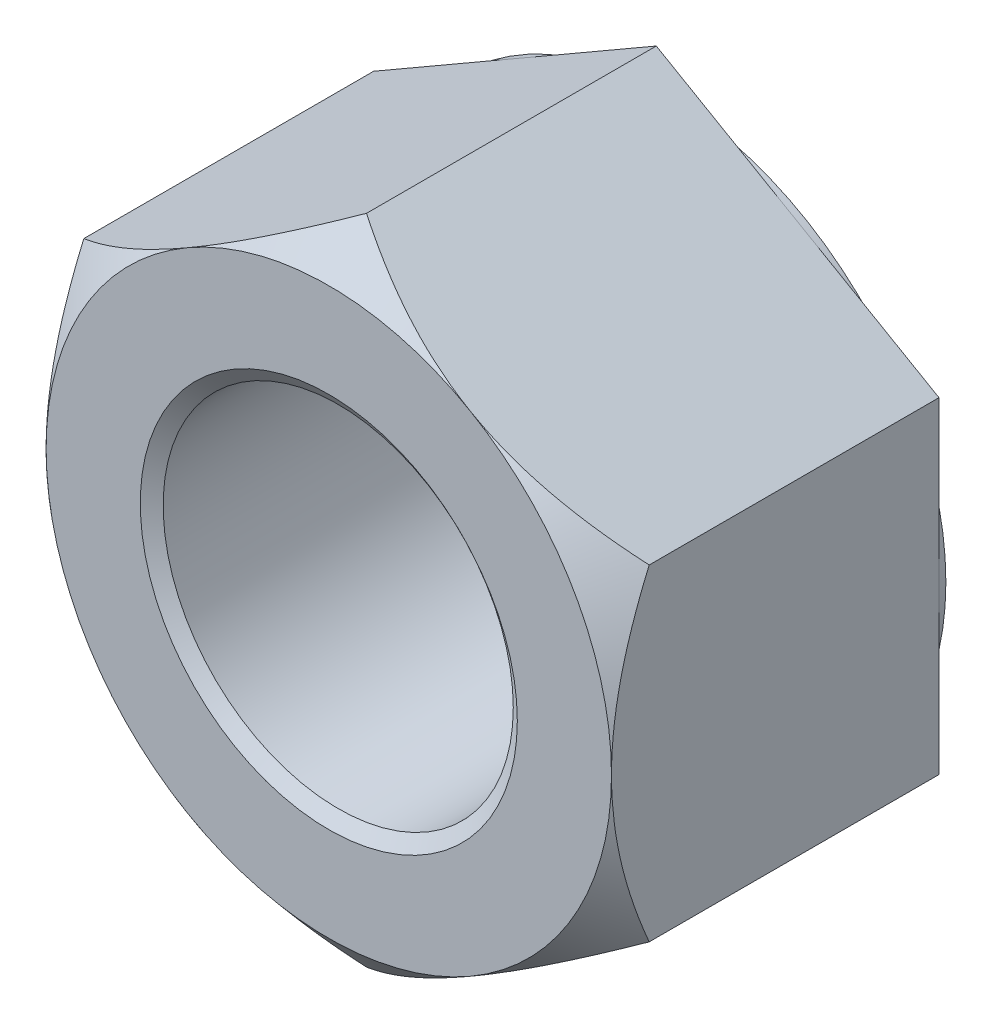
ISO-10303-21;
HEADER;
FILE_DESCRIPTION(('STEP AP214'),'2;1');
FILE_NAME('part.step','',(''),(''),'','','');
FILE_SCHEMA(('AUTOMOTIVE_DESIGN { 1 0 10303 214 1 1 1 1 }'));
ENDSEC;
DATA;
#1=APPLICATION_CONTEXT('core data for automotive mechanical design processes');
#2=APPLICATION_PROTOCOL_DEFINITION('international standard','automotive_design',2000,#1);
#3=PRODUCT_CONTEXT('',#1,'mechanical');
#4=PRODUCT('Part','Part','',(#3));
#5=PRODUCT_RELATED_PRODUCT_CATEGORY('part','',(#4));
#6=PRODUCT_DEFINITION_FORMATION('','',#4);
#7=PRODUCT_DEFINITION_CONTEXT('part definition',#1,'design');
#8=PRODUCT_DEFINITION('design','',#6,#7);
#9=PRODUCT_DEFINITION_SHAPE('','',#8);
#10=(LENGTH_UNIT() NAMED_UNIT(*) SI_UNIT(.MILLI.,.METRE.));
#11=(NAMED_UNIT(*) PLANE_ANGLE_UNIT() SI_UNIT($,.RADIAN.));
#12=(NAMED_UNIT(*) SI_UNIT($,.STERADIAN.) SOLID_ANGLE_UNIT());
#13=UNCERTAINTY_MEASURE_WITH_UNIT(LENGTH_MEASURE(1.E-05),#10,'distance_accuracy_value','');
#14=(GEOMETRIC_REPRESENTATION_CONTEXT(3) GLOBAL_UNCERTAINTY_ASSIGNED_CONTEXT((#13)) GLOBAL_UNIT_ASSIGNED_CONTEXT((#10,
#11,#12)) REPRESENTATION_CONTEXT('',''));
#15=CARTESIAN_POINT('',(0.,0.,0.));
#16=DIRECTION('',(0.,0.,1.));
#17=DIRECTION('',(1.,0.,0.));
#18=AXIS2_PLACEMENT_3D('',#15,#16,#17);
#19=CARTESIAN_POINT('',(0.,0.,-19.7104));
#20=DIRECTION('',(0.,0.,1.));
#21=DIRECTION('',(1.,0.,0.));
#22=AXIS2_PLACEMENT_3D('',#19,#20,#21);
#23=CYLINDRICAL_SURFACE('',#22,10.31875);
#24=CARTESIAN_POINT('',(0.,0.,-0.555789733453959));
#25=DIRECTION('',(0.,0.,1.));
#26=DIRECTION('',(1.,0.,0.));
#27=AXIS2_PLACEMENT_3D('',#24,#25,#26);
#28=CIRCLE('',#27,10.31875);
#29=CARTESIAN_POINT('',(10.31875,0.,-0.555789733453959));
#30=VERTEX_POINT('',#29);
#31=EDGE_CURVE('E159',#30,#30,#28,.F.);
#32=ORIENTED_EDGE('',*,*,#31,.F.);
#33=EDGE_LOOP('',(#32));
#34=FACE_BOUND('',#33,.T.);
#35=CARTESIAN_POINT('',(0.,0.,-19.129210266546));
#36=DIRECTION('',(0.,0.,-1.));
#37=DIRECTION('',(-1.,0.,0.));
#38=AXIS2_PLACEMENT_3D('',#35,#36,#37);
#39=CIRCLE('',#38,10.31875);
#40=CARTESIAN_POINT('',(-10.31875,0.,-19.129210266546));
#41=VERTEX_POINT('',#40);
#42=EDGE_CURVE('E47',#41,#41,#39,.F.);
#43=ORIENTED_EDGE('',*,*,#42,.F.);
#44=EDGE_LOOP('',(#43));
#45=FACE_BOUND('',#44,.T.);
#46=ADVANCED_FACE('F42',(#34,#45),#23,.F.);
#47=CARTESIAN_POINT('',(0.,19.2400822506905,-19.7104));
#48=DIRECTION('',(-0.500000000000001,0.866025403784438,0.));
#49=DIRECTION('',(-0.866025403784438,-0.500000000000001,0.));
#50=AXIS2_PLACEMENT_3D('',#47,#48,#49);
#51=PLANE('',#50);
#52=DIRECTION('',(0.,0.,1.));
#53=VECTOR('',#52,1.);
#54=CARTESIAN_POINT('',(-16.6624,9.62004112534521,-19.7104));
#55=LINE('',#54,#53);
#56=CARTESIAN_POINT('',(-16.6624,9.62004112534521,-19.304));
#57=VERTEX_POINT('',#56);
#58=CARTESIAN_POINT('',(-16.6624,9.62004112534521,-2.2225));
#59=VERTEX_POINT('',#58);
#60=EDGE_CURVE('E297',#57,#59,#55,.T.);
#61=ORIENTED_EDGE('',*,*,#60,.T.);
#62=CARTESIAN_POINT('',(-16.6626,9.61992565529138,-2.22259956017846));
#63=CARTESIAN_POINT('',(-16.3359914069942,9.80849321438293,-2.06004001330328));
#64=CARTESIAN_POINT('',(-16.00708321829,9.99838844566996,-1.90345067500589));
#65=CARTESIAN_POINT('',(-15.3443547456618,10.3810149077415,-1.60414393365779));
#66=CARTESIAN_POINT('',(-15.0105316908675,10.5737477382887,-1.46143472987974));
#67=CARTESIAN_POINT('',(-14.3363366999857,10.9629943977606,-1.19133148853535));
#68=CARTESIAN_POINT('',(-13.9959401193921,11.1595224551975,-1.06401888683919));
#69=CARTESIAN_POINT('',(-13.3104110131345,11.5553128692327,-0.827853893406277));
#70=CARTESIAN_POINT('',(-12.9652792905679,11.7545747621624,-0.71899841210642));
#71=CARTESIAN_POINT('',(-12.2767892060713,12.1520746977809,-0.52380403910565));
#72=CARTESIAN_POINT('',(-11.9335096331595,12.3502672516088,-0.437097069433945));
#73=CARTESIAN_POINT('',(-11.2432752736687,12.7487742448647,-0.285791409597032));
#74=CARTESIAN_POINT('',(-10.8963203779458,12.949088747307,-0.221193377896618));
#75=CARTESIAN_POINT('',(-10.2004495898861,13.3508499341145,-0.115998073839297));
#76=CARTESIAN_POINT('',(-9.85153970898105,13.5522931477779,-0.0753481902800202));
#77=CARTESIAN_POINT('',(-9.15221444494224,13.9560487772219,-0.0190524535448443));
#78=CARTESIAN_POINT('',(-8.80179917204902,14.1583611293549,-0.00340479971755249));
#79=CARTESIAN_POINT('',(-8.14974966016309,14.5348220905672,0.00200363509268597));
#80=CARTESIAN_POINT('',(-7.84813263016975,14.708960764026,-0.00492755747404597));
#81=CARTESIAN_POINT('',(-7.24566622078218,15.0567949076637,-0.0374814638258579));
#82=CARTESIAN_POINT('',(-6.94481681594919,15.2304903925295,-0.0631035499129201));
#83=CARTESIAN_POINT('',(-6.34447690427329,15.5770968021409,-0.132482558325232));
#84=CARTESIAN_POINT('',(-6.04498756801866,15.7500070510469,-0.176252888992827));
#85=CARTESIAN_POINT('',(-5.44828309973434,16.0945145364375,-0.280989484638122));
#86=CARTESIAN_POINT('',(-5.15106800050004,16.2661117539877,-0.341955997113344));
#87=CARTESIAN_POINT('',(-4.55940348198139,16.6077094230244,-0.479902459422663));
#88=CARTESIAN_POINT('',(-4.26495448462101,16.777709630913,-0.556884812055613));
#89=CARTESIAN_POINT('',(-3.67921044969725,17.1158891071525,-0.725521314999777));
#90=CARTESIAN_POINT('',(-3.38791589012623,17.2840680995343,-0.817177656546836));
#91=CARTESIAN_POINT('',(-2.51940637621614,17.785502301184,-1.11195820496731));
#92=CARTESIAN_POINT('',(-1.94718945013523,18.1158718974917,-1.3349849912843));
#93=CARTESIAN_POINT('',(-1.14906027506947,18.576671991564,-1.67975192686912));
#94=CARTESIAN_POINT('',(-0.917263659966787,18.7104998296908,-1.78398664917475));
#95=CARTESIAN_POINT('',(-0.456557869340144,18.9764884419263,-1.99871269404115));
#96=CARTESIAN_POINT('',(-0.227642719410924,19.1086526653595,-2.10918690693679));
#97=CARTESIAN_POINT('',(0.000200000000011601,19.2401977207443,-2.22259956017845));
#98=B_SPLINE_CURVE_WITH_KNOTS('',3,(#62,#63,#64,#65,#66,#67,#68,#69,#70,#71,#72,#73,#74,#75,#76,
#77,#78,#79,#80,#81,#82,#83,#84,#85,#86,#87,#88,#89,#90,#91,#92,#93,#94,#95,#96,#97),
.UNSPECIFIED.,.F.,.F.,(4,2,2,2,2,2,2,2,2,2,2,2,2,2,2,2,2,4),(0.,1.23209467877341,
2.46491281546341,3.70399013963489,4.94285984772324,6.15955981590395,7.37629601759317,
8.59034913099073,9.80431480478778,10.8488580904928,11.8933662988182,12.9386475929475,
13.9839439321452,15.0293972066247,16.0750067423026,18.1648984651463,19.026559859433,
19.8859634648151),.UNSPECIFIED.);
#99=CARTESIAN_POINT('',(-8.33120000000001,14.4300616880178,0.));
#100=VERTEX_POINT('',#99);
#101=EDGE_CURVE('E145',#59,#100,#98,.T.);
#102=ORIENTED_EDGE('',*,*,#101,.T.);
#103=CARTESIAN_POINT('',(0.,19.2400822506905,-2.2225));
#104=VERTEX_POINT('',#103);
#105=EDGE_CURVE('E172',#100,#104,#98,.T.);
#106=ORIENTED_EDGE('',*,*,#105,.T.);
#107=DIRECTION('',(0.,0.,1.));
#108=VECTOR('',#107,1.);
#109=CARTESIAN_POINT('',(0.,19.2400822506905,-19.7104));
#110=LINE('',#109,#108);
#111=CARTESIAN_POINT('',(0.,19.2400822506905,-19.304));
#112=VERTEX_POINT('',#111);
#113=EDGE_CURVE('E285',#112,#104,#110,.T.);
#114=ORIENTED_EDGE('',*,*,#113,.F.);
#115=DIRECTION('',(-0.866025403784438,-0.500000000000001,0.));
#116=VECTOR('',#115,1.);
#117=CARTESIAN_POINT('',(0.,19.2400822506905,-19.304));
#118=LINE('',#117,#116);
#119=CARTESIAN_POINT('',(-8.33120000000001,14.4300616880178,-19.304));
#120=VERTEX_POINT('',#119);
#121=EDGE_CURVE('E273',#112,#120,#118,.T.);
#122=ORIENTED_EDGE('',*,*,#121,.T.);
#123=EDGE_CURVE('E269',#120,#57,#118,.T.);
#124=ORIENTED_EDGE('',*,*,#123,.T.);
#125=EDGE_LOOP('',(#61,#102,#106,#114,#122,#124));
#126=FACE_BOUND('',#125,.T.);
#127=ADVANCED_FACE('F44',(#126),#51,.T.);
#128=CARTESIAN_POINT('',(16.6624,9.62004112534521,-19.7104));
#129=DIRECTION('',(0.500000000000001,0.866025403784438,0.));
#130=DIRECTION('',(-0.866025403784438,0.500000000000001,0.));
#131=AXIS2_PLACEMENT_3D('',#128,#129,#130);
#132=PLANE('',#131);
#133=ORIENTED_EDGE('',*,*,#113,.T.);
#134=CARTESIAN_POINT('',(-0.000199999999995952,19.2401977207443,-2.22259956017847));
#135=CARTESIAN_POINT('',(0.326408593005819,19.0516301616527,-2.06004001330329));
#136=CARTESIAN_POINT('',(0.655316781710009,18.8617349303657,-1.9034506750059));
#137=CARTESIAN_POINT('',(1.31804525433819,18.4791084682942,-1.6041439336578));
#138=CARTESIAN_POINT('',(1.65186830913254,18.286375637747,-1.46143472987975));
#139=CARTESIAN_POINT('',(2.32606330001435,17.8971289782751,-1.19133148853536));
#140=CARTESIAN_POINT('',(2.6664598806079,17.7006009208381,-1.06401888683919));
#141=CARTESIAN_POINT('',(3.35198898686555,17.304810506803,-0.82785389340628));
#142=CARTESIAN_POINT('',(3.69712070943212,17.1055486138733,-0.718998412106425));
#143=CARTESIAN_POINT('',(4.38561079392877,16.7080486782547,-0.523804039105654));
#144=CARTESIAN_POINT('',(4.72889036684054,16.5098561244268,-0.437097069433946));
#145=CARTESIAN_POINT('',(5.41912472633128,16.1113491311709,-0.285791409597032));
#146=CARTESIAN_POINT('',(5.76607962205423,15.9110346287286,-0.221193377896621));
#147=CARTESIAN_POINT('',(6.46195041011389,15.5092734419212,-0.1159980738393));
#148=CARTESIAN_POINT('',(6.81086029101898,15.3078302282577,-0.0753481902800202));
#149=CARTESIAN_POINT('',(7.51018555505779,14.9040745988138,-0.0190524535448429));
#150=CARTESIAN_POINT('',(7.86060082795101,14.7017622466807,-0.00340479971755274));
#151=CARTESIAN_POINT('',(8.51265033983695,14.3253012854684,0.0020036350926848));
#152=CARTESIAN_POINT('',(8.81426736983028,14.1511626120096,-0.00492755747404684));
#153=CARTESIAN_POINT('',(9.41673377921785,13.803328468372,-0.03748146382586));
#154=CARTESIAN_POINT('',(9.71758318405085,13.6296329835061,-0.0631035499129238));
#155=CARTESIAN_POINT('',(10.3179230957267,13.2830265738947,-0.132482558325236));
#156=CARTESIAN_POINT('',(10.6174124319814,13.1101163249887,-0.17625288899283));
#157=CARTESIAN_POINT('',(11.2141169002657,12.7656088395981,-0.280989484638124));
#158=CARTESIAN_POINT('',(11.5113319995,12.594011622048,-0.341955997113345));
#159=CARTESIAN_POINT('',(12.1029965180186,12.2524139530113,-0.479902459422664));
#160=CARTESIAN_POINT('',(12.397445515379,12.0824137451226,-0.556884812055615));
#161=CARTESIAN_POINT('',(12.9831895503028,11.7442342688832,-0.72552131499978));
#162=CARTESIAN_POINT('',(13.2744841098738,11.5760552765014,-0.817177656546841));
#163=CARTESIAN_POINT('',(14.1429936237839,11.0746210748516,-1.11195820496731));
#164=CARTESIAN_POINT('',(14.7152105498648,10.744251478544,-1.33498499128431));
#165=CARTESIAN_POINT('',(15.5133397249306,10.2834513844717,-1.67975192686912));
#166=CARTESIAN_POINT('',(15.7451363400332,10.1496235463449,-1.78398664917475));
#167=CARTESIAN_POINT('',(16.2058421306599,9.88363493410938,-1.99871269404114));
#168=CARTESIAN_POINT('',(16.4347572805891,9.75147071067616,-2.10918690693678));
#169=CARTESIAN_POINT('',(16.6626,9.61992565529137,-2.22259956017843));
#170=B_SPLINE_CURVE_WITH_KNOTS('',3,(#134,#135,#136,#137,#138,#139,#140,#141,#142,#143,#144,
#145,#146,#147,#148,#149,#150,#151,#152,#153,#154,#155,#156,#157,#158,#159,#160,#161,#162,#163,
#164,#165,#166,#167,#168,#169),.UNSPECIFIED.,.F.,.F.,(4,2,2,2,2,2,2,2,2,2,2,2,2,2,2,2,2,4),(0.,
1.23209467877342,2.46491281546343,3.70399013963491,4.94285984772326,6.15955981590398,
7.3762960175932,8.59034913099077,9.80431480478781,10.8488580904928,11.8933662988182,
12.9386475929475,13.9839439321452,15.0293972066247,16.0750067423026,18.1648984651463,
19.026559859433,19.8859634648151),.UNSPECIFIED.);
#171=CARTESIAN_POINT('',(8.33120000000002,14.4300616880178,0.));
#172=VERTEX_POINT('',#171);
#173=EDGE_CURVE('E168',#104,#172,#170,.T.);
#174=ORIENTED_EDGE('',*,*,#173,.T.);
#175=CARTESIAN_POINT('',(16.6624,9.62004112534524,-2.2225));
#176=VERTEX_POINT('',#175);
#177=EDGE_CURVE('E154',#172,#176,#170,.T.);
#178=ORIENTED_EDGE('',*,*,#177,.T.);
#179=DIRECTION('',(0.,0.,1.));
#180=VECTOR('',#179,1.);
#181=CARTESIAN_POINT('',(16.6624,9.62004112534521,-19.7104));
#182=LINE('',#181,#180);
#183=CARTESIAN_POINT('',(16.6624,9.62004112534521,-19.304));
#184=VERTEX_POINT('',#183);
#185=EDGE_CURVE('E167',#184,#176,#182,.T.);
#186=ORIENTED_EDGE('',*,*,#185,.F.);
#187=DIRECTION('',(-0.866025403784438,0.500000000000001,0.));
#188=VECTOR('',#187,1.);
#189=CARTESIAN_POINT('',(16.6624,9.62004112534521,-19.304));
#190=LINE('',#189,#188);
#191=CARTESIAN_POINT('',(8.33120000000002,14.4300616880178,-19.304));
#192=VERTEX_POINT('',#191);
#193=EDGE_CURVE('E281',#184,#192,#190,.T.);
#194=ORIENTED_EDGE('',*,*,#193,.T.);
#195=EDGE_CURVE('E277',#192,#112,#190,.T.);
#196=ORIENTED_EDGE('',*,*,#195,.T.);
#197=EDGE_LOOP('',(#133,#174,#178,#186,#194,#196));
#198=FACE_BOUND('',#197,.T.);
#199=ADVANCED_FACE('F244',(#198),#132,.T.);
#200=CARTESIAN_POINT('',(16.6624,9.62004112534521,-19.7104));
#201=DIRECTION('',(-1.,0.,0.));
#202=DIRECTION('',(0.,0.,1.));
#203=AXIS2_PLACEMENT_3D('',#200,#201,#202);
#204=PLANE('',#203);
#205=CARTESIAN_POINT('',(16.6624,-21.2910823045023,-8.94421530935966));
#206=CARTESIAN_POINT('',(16.6624,-21.021799600833,-8.76137654101946));
#207=CARTESIAN_POINT('',(16.6624,-20.7519081407798,-8.57943496312224));
#208=CARTESIAN_POINT('',(16.6624,-20.2108004374464,-8.21752390880637));
#209=CARTESIAN_POINT('',(16.6624,-19.9395841736655,-8.03755446304612));
#210=CARTESIAN_POINT('',(16.6624,-19.1236875722252,-7.50080553839117));
#211=CARTESIAN_POINT('',(16.6624,-18.576870509711,-7.14726110440717));
#212=CARTESIAN_POINT('',(16.6624,-17.4727069043687,-6.44814459088069));
#213=CARTESIAN_POINT('',(16.6624,-16.9153131850005,-6.10264685406429));
#214=CARTESIAN_POINT('',(16.6624,-15.7927026633144,-5.42464228063923));
#215=CARTESIAN_POINT('',(16.6624,-15.2274863570329,-5.09213462538433));
#216=CARTESIAN_POINT('',(16.6624,-14.0569577700893,-4.42553096834549));
#217=CARTESIAN_POINT('',(16.6624,-13.4511342661326,-4.09232822813405));
#218=CARTESIAN_POINT('',(16.6624,-12.2274825861869,-3.44835872309412));
#219=CARTESIAN_POINT('',(16.6624,-11.6096526667249,-3.13759524807867));
#220=CARTESIAN_POINT('',(16.6624,-10.3620171384647,-2.54549730173442));
#221=CARTESIAN_POINT('',(16.6624,-9.73224869948089,-2.26408503748029));
#222=CARTESIAN_POINT('',(16.6624,-8.45773981879862,-1.73760719213253));
#223=CARTESIAN_POINT('',(16.6624,-7.81300568694947,-1.49252660358593));
#224=CARTESIAN_POINT('',(16.6624,-6.84341414888958,-1.16246361932534));
#225=CARTESIAN_POINT('',(16.6624,-6.52449067724854,-1.0599439187607));
#226=CARTESIAN_POINT('',(16.6624,-5.88300369459683,-0.866957121136919));
#227=CARTESIAN_POINT('',(16.6624,-5.56044029245351,-0.776489664635937));
#228=CARTESIAN_POINT('',(16.6624,-4.91184231181548,-0.608837129405586));
#229=CARTESIAN_POINT('',(16.6624,-4.58580748761446,-0.531652997592205));
#230=CARTESIAN_POINT('',(16.6624,-3.93064559858776,-0.391787666981033));
#231=CARTESIAN_POINT('',(16.6624,-3.60151872545464,-0.329105575218603));
#232=CARTESIAN_POINT('',(16.6624,-2.94680318937387,-0.220361502519273));
#233=CARTESIAN_POINT('',(16.6624,-2.62126245824348,-0.174012273718032));
#234=CARTESIAN_POINT('',(16.6624,-1.96830317162107,-0.0972023764870752));
#235=CARTESIAN_POINT('',(16.6624,-1.6408846310804,-0.0667415817288484));
#236=CARTESIAN_POINT('',(16.6624,-0.984952303289035,-0.0223174171803623));
#237=CARTESIAN_POINT('',(16.6624,-0.65643861192698,-0.00835263921002644));
#238=CARTESIAN_POINT('',(16.6624,0.000872477808140236,0.0027935217455645));
#239=CARTESIAN_POINT('',(16.6624,0.329669872009159,-2.48525296919069E-05));
#240=CARTESIAN_POINT('',(16.6624,0.964734951699052,-0.0216356067803289));
#241=CARTESIAN_POINT('',(16.6624,1.27104011801974,-0.0393480941782969));
#242=CARTESIAN_POINT('',(16.6624,1.88249431713951,-0.089015237567592));
#243=CARTESIAN_POINT('',(16.6624,2.18764333165348,-0.120970117869103));
#244=CARTESIAN_POINT('',(16.6624,2.79619390501557,-0.198576539573703));
#245=CARTESIAN_POINT('',(16.6624,3.0995954166581,-0.244228449224743));
#246=CARTESIAN_POINT('',(16.6624,3.70415498471399,-0.34849899000296));
#247=CARTESIAN_POINT('',(16.6624,4.00531301512637,-0.407117771169554));
#248=CARTESIAN_POINT('',(16.6624,4.61123511088763,-0.537808921748901));
#249=CARTESIAN_POINT('',(16.6624,4.91594415258989,-0.610135438864115));
#250=CARTESIAN_POINT('',(16.6624,5.52235436072562,-0.766419934672912));
#251=CARTESIAN_POINT('',(16.6624,5.82405550053746,-0.85037801621467));
#252=CARTESIAN_POINT('',(16.6624,6.4242117885142,-1.02889113039496));
#253=CARTESIAN_POINT('',(16.6624,6.72266775292029,-1.12344342736422));
#254=CARTESIAN_POINT('',(16.6624,7.31633468370641,-1.32216697493462));
#255=CARTESIAN_POINT('',(16.6624,7.61154573700844,-1.42633796717197));
#256=CARTESIAN_POINT('',(16.6624,8.44190952678454,-1.73321432265742));
#257=CARTESIAN_POINT('',(16.6624,8.97332140788195,-1.94608205953689));
#258=CARTESIAN_POINT('',(16.6624,10.0260383349042,-2.39562984712675));
#259=CARTESIAN_POINT('',(16.6624,10.5473404445858,-2.63231669580112));
#260=CARTESIAN_POINT('',(16.6624,11.5811917231476,-3.1254074747567));
#261=CARTESIAN_POINT('',(16.6624,12.0937306750032,-3.38183272600107));
#262=CARTESIAN_POINT('',(16.6624,13.1104235323694,-3.91061794155119));
#263=CARTESIAN_POINT('',(16.6624,13.6145781588393,-4.18297652657257));
#264=CARTESIAN_POINT('',(16.6624,14.6185657598226,-4.74250747519285));
#265=CARTESIAN_POINT('',(16.6624,15.118354271484,-5.02975934218772));
#266=CARTESIAN_POINT('',(16.6624,16.1114398333225,-5.61526117570992));
#267=CARTESIAN_POINT('',(16.6624,16.6047367666073,-5.91351133991411));
#268=CARTESIAN_POINT('',(16.6624,17.5853874478019,-6.51900468316247));
#269=CARTESIAN_POINT('',(16.6624,18.0727443538005,-6.82624275921777));
#270=CARTESIAN_POINT('',(16.6624,19.0425141347451,-7.44840196364405));
#271=CARTESIAN_POINT('',(16.6624,19.5249270525651,-7.76332302530822));
#272=CARTESIAN_POINT('',(16.6624,20.438065888067,-8.36828452282147));
#273=CARTESIAN_POINT('',(16.6624,20.8691965045552,-8.65771513319295));
#274=CARTESIAN_POINT('',(16.6624,21.7283479051946,-9.24115903295721));
#275=CARTESIAN_POINT('',(16.6624,22.1563686574298,-9.5351723692847));
#276=CARTESIAN_POINT('',(16.6624,23.4364050870605,-10.4232435425663));
#277=CARTESIAN_POINT('',(16.6624,24.2842898481347,-11.0232624956962));
#278=CARTESIAN_POINT('',(16.6624,25.5439344066446,-11.9284346113313));
#279=CARTESIAN_POINT('',(16.6624,25.9590294686008,-12.2289746887623));
#280=CARTESIAN_POINT('',(16.6624,26.7872907619616,-12.8327059078819));
#281=CARTESIAN_POINT('',(16.6624,27.2004569893995,-13.1358970550187));
#282=CARTESIAN_POINT('',(16.6624,28.0249453394474,-13.7445489151267));
#283=CARTESIAN_POINT('',(16.6624,28.4362679167781,-14.0500090127689));
#284=CARTESIAN_POINT('',(16.6624,29.2573377236052,-14.6630310399109));
#285=CARTESIAN_POINT('',(16.6624,29.6670849688378,-14.9705929483297));
#286=CARTESIAN_POINT('',(16.6624,30.0761285870628,-15.2790857083295));
#287=B_SPLINE_CURVE_WITH_KNOTS('',3,(#205,#206,#207,#208,#209,#210,#211,#212,#213,#214,#215,
#216,#217,#218,#219,#220,#221,#222,#223,#224,#225,#226,#227,#228,#229,#230,#231,#232,#233,#234,
#235,#236,#237,#238,#239,#240,#241,#242,#243,#244,#245,#246,#247,#248,#249,#250,#251,#252,#253,
#254,#255,#256,#257,#258,#259,#260,#261,#262,#263,#264,#265,#266,#267,#268,#269,#270,#271,#272,
#273,#274,#275,#276,#277,#278,#279,#280,#281,#282,#283,#284,#285,#286),.UNSPECIFIED.,.F.,.F.,(4,
2,2,2,2,2,2,2,2,2,2,2,2,2,2,2,2,2,2,2,2,2,2,2,2,2,2,2,2,2,2,2,2,2,2,2,2,2,2,2,4),(0.,
0.976464115336027,1.95294338913439,3.90630505947433,5.87352309214781,7.84061694837618,
9.9144734631033,11.9886334104718,14.057148263776,16.124806284595,17.129601304414,
18.1343663508709,19.1392029934356,20.1439777466015,21.1300778020169,22.1161700168578,
23.1021780479954,24.0881718182541,25.0082859639583,25.9284146014876,26.8485679791152,
27.7687320043766,28.7080082039382,29.6472927092621,30.5863352263476,31.5253525275328,
33.2419538331811,34.9590464530088,36.6780205907882,38.3968461434762,40.1260480706171,
41.8552810925674,43.5835506817989,45.3118052708238,46.8695887321723,48.4273881583046,
51.5433658320802,53.0807783239191,54.6181939760877,56.155206894701,57.6922044197716),.UNSPECIFIED.);
#288=CARTESIAN_POINT('',(16.6624,-9.62004112534525,-2.2225));
#289=VERTEX_POINT('',#288);
#290=CARTESIAN_POINT('',(16.6624,0.,0.));
#291=VERTEX_POINT('',#290);
#292=EDGE_CURVE('E134',#289,#291,#287,.T.);
#293=ORIENTED_EDGE('',*,*,#292,.F.);
#294=DIRECTION('',(0.,0.,1.));
#295=VECTOR('',#294,1.);
#296=CARTESIAN_POINT('',(16.6624,-9.62004112534524,-19.7104));
#297=LINE('',#296,#295);
#298=CARTESIAN_POINT('',(16.6624,-9.62004112534524,-19.304));
#299=VERTEX_POINT('',#298);
#300=EDGE_CURVE('E290',#299,#289,#297,.T.);
#301=ORIENTED_EDGE('',*,*,#300,.F.);
#302=DIRECTION('',(0.,-1.,0.));
#303=VECTOR('',#302,1.);
#304=CARTESIAN_POINT('',(16.6624,9.62004112534521,-19.304));
#305=LINE('',#304,#303);
#306=CARTESIAN_POINT('',(16.6624,0.,-19.304));
#307=VERTEX_POINT('',#306);
#308=EDGE_CURVE('E282',#307,#299,#305,.T.);
#309=ORIENTED_EDGE('',*,*,#308,.F.);
#310=EDGE_CURVE('E284',#184,#307,#305,.T.);
#311=ORIENTED_EDGE('',*,*,#310,.F.);
#312=ORIENTED_EDGE('',*,*,#185,.T.);
#313=EDGE_CURVE('E147',#291,#176,#287,.T.);
#314=ORIENTED_EDGE('',*,*,#313,.F.);
#315=EDGE_LOOP('',(#293,#301,#309,#311,#312,#314));
#316=FACE_BOUND('',#315,.T.);
#317=ADVANCED_FACE('F164',(#316),#204,.F.);
#318=CARTESIAN_POINT('',(0.,-19.2400822506905,-19.7104));
#319=DIRECTION('',(0.500000000000001,-0.866025403784438,0.));
#320=DIRECTION('',(0.866025403784438,0.500000000000001,0.));
#321=AXIS2_PLACEMENT_3D('',#318,#319,#320);
#322=PLANE('',#321);
#323=ORIENTED_EDGE('',*,*,#300,.T.);
#324=CARTESIAN_POINT('',(16.6626,-9.61992565529141,-2.22259956017847));
#325=CARTESIAN_POINT('',(16.3359914069942,-9.80849321438296,-2.06004001330329));
#326=CARTESIAN_POINT('',(16.00708321829,-9.99838844566999,-1.9034506750059));
#327=CARTESIAN_POINT('',(15.3443547456618,-10.3810149077415,-1.60414393365781));
#328=CARTESIAN_POINT('',(15.0105316908675,-10.5737477382887,-1.46143472987976));
#329=CARTESIAN_POINT('',(14.3363366999857,-10.9629943977606,-1.19133148853537));
#330=CARTESIAN_POINT('',(13.9959401193921,-11.1595224551975,-1.0640188868392));
#331=CARTESIAN_POINT('',(13.3104110131345,-11.5553128692327,-0.827853893406297));
#332=CARTESIAN_POINT('',(12.9652792905679,-11.7545747621624,-0.718998412106441));
#333=CARTESIAN_POINT('',(12.2767892060713,-12.1520746977809,-0.523804039105672));
#334=CARTESIAN_POINT('',(11.9335096331595,-12.3502672516088,-0.437097069433966));
#335=CARTESIAN_POINT('',(11.2432752736688,-12.7487742448648,-0.285791409597055));
#336=CARTESIAN_POINT('',(10.8963203779458,-12.9490887473071,-0.221193377896644));
#337=CARTESIAN_POINT('',(10.2004495898861,-13.3508499341145,-0.115998073839323));
#338=CARTESIAN_POINT('',(9.85153970898106,-13.552293147778,-0.0753481902800437));
#339=CARTESIAN_POINT('',(9.15221444494225,-13.9560487772219,-0.0190524535448672));
#340=CARTESIAN_POINT('',(8.80179917204903,-14.1583611293549,-0.00340479971757718));
#341=CARTESIAN_POINT('',(8.1497496601631,-14.5348220905673,0.00200363509265852));
#342=CARTESIAN_POINT('',(7.84813263016977,-14.7089607640261,-0.00492755747407457));
#343=CARTESIAN_POINT('',(7.2456662207822,-15.0567949076637,-0.0374814638258869));
#344=CARTESIAN_POINT('',(6.9448168159492,-15.2304903925296,-0.0631035499129482));
#345=CARTESIAN_POINT('',(6.3444769042733,-15.5770968021409,-0.132482558325257));
#346=CARTESIAN_POINT('',(6.04498756801867,-15.750007051047,-0.176252888992851));
#347=CARTESIAN_POINT('',(5.44828309973435,-16.0945145364376,-0.280989484638144));
#348=CARTESIAN_POINT('',(5.15106800050005,-16.2661117539877,-0.341955997113366));
#349=CARTESIAN_POINT('',(4.55940348198141,-16.6077094230244,-0.479902459422686));
#350=CARTESIAN_POINT('',(4.26495448462102,-16.777709630913,-0.556884812055639));
#351=CARTESIAN_POINT('',(3.67921044969726,-17.1158891071525,-0.725521314999804));
#352=CARTESIAN_POINT('',(3.38791589012624,-17.2840680995343,-0.817177656546864));
#353=CARTESIAN_POINT('',(2.51940637621616,-17.785502301184,-1.11195820496733));
#354=CARTESIAN_POINT('',(1.94718945013524,-18.1158718974917,-1.33498499128432));
#355=CARTESIAN_POINT('',(1.14906027506949,-18.576671991564,-1.67975192686914));
#356=CARTESIAN_POINT('',(0.9172636599668,-18.7104998296908,-1.78398664917478));
#357=CARTESIAN_POINT('',(0.456557869340154,-18.9764884419263,-1.99871269404118));
#358=CARTESIAN_POINT('',(0.227642719410931,-19.1086526653595,-2.10918690693682));
#359=CARTESIAN_POINT('',(-0.000200000000008524,-19.2401977207443,-2.22259956017848));
#360=B_SPLINE_CURVE_WITH_KNOTS('',3,(#324,#325,#326,#327,#328,#329,#330,#331,#332,#333,#334,
#335,#336,#337,#338,#339,#340,#341,#342,#343,#344,#345,#346,#347,#348,#349,#350,#351,#352,#353,
#354,#355,#356,#357,#358,#359),.UNSPECIFIED.,.F.,.F.,(4,2,2,2,2,2,2,2,2,2,2,2,2,2,2,2,2,4),(0.,
1.23209467877341,2.46491281546341,3.70399013963489,4.94285984772323,6.15955981590394,
7.37629601759316,8.59034913099072,9.80431480478776,10.8488580904928,11.8933662988181,
12.9386475929474,13.9839439321452,15.0293972066247,16.0750067423026,18.1648984651463,
19.026559859433,19.8859634648151),.UNSPECIFIED.);
#361=CARTESIAN_POINT('',(8.33120000000002,-14.4300616880178,0.));
#362=VERTEX_POINT('',#361);
#363=EDGE_CURVE('E140',#289,#362,#360,.T.);
#364=ORIENTED_EDGE('',*,*,#363,.T.);
#365=CARTESIAN_POINT('',(0.,-19.2400822506905,-2.2225));
#366=VERTEX_POINT('',#365);
#367=EDGE_CURVE('E61',#362,#366,#360,.T.);
#368=ORIENTED_EDGE('',*,*,#367,.T.);
#369=DIRECTION('',(0.,0.,1.));
#370=VECTOR('',#369,1.);
#371=CARTESIAN_POINT('',(0.,-19.2400822506905,-19.7104));
#372=LINE('',#371,#370);
#373=CARTESIAN_POINT('',(0.,-19.2400822506905,-19.304));
#374=VERTEX_POINT('',#373);
#375=EDGE_CURVE('E292',#374,#366,#372,.T.);
#376=ORIENTED_EDGE('',*,*,#375,.F.);
#377=DIRECTION('',(0.866025403784438,0.500000000000001,0.));
#378=VECTOR('',#377,1.);
#379=CARTESIAN_POINT('',(0.,-19.2400822506905,-19.304));
#380=LINE('',#379,#378);
#381=CARTESIAN_POINT('',(8.33120000000003,-14.4300616880179,-19.304));
#382=VERTEX_POINT('',#381);
#383=EDGE_CURVE('E274',#374,#382,#380,.T.);
#384=ORIENTED_EDGE('',*,*,#383,.T.);
#385=EDGE_CURVE('E278',#382,#299,#380,.T.);
#386=ORIENTED_EDGE('',*,*,#385,.T.);
#387=EDGE_LOOP('',(#323,#364,#368,#376,#384,#386));
#388=FACE_BOUND('',#387,.T.);
#389=ADVANCED_FACE('F225',(#388),#322,.T.);
#390=CARTESIAN_POINT('',(-16.6624,-9.62004112534524,-19.7104));
#391=DIRECTION('',(-0.500000000000001,-0.866025403784438,0.));
#392=DIRECTION('',(0.866025403784438,-0.500000000000001,0.));
#393=AXIS2_PLACEMENT_3D('',#390,#391,#392);
#394=PLANE('',#393);
#395=ORIENTED_EDGE('',*,*,#375,.T.);
#396=CARTESIAN_POINT('',(0.000199999999999499,-19.2401977207443,-2.2225995601785));
#397=CARTESIAN_POINT('',(-0.326408593005817,-19.0516301616528,-2.06004001330332));
#398=CARTESIAN_POINT('',(-0.655316781710008,-18.8617349303657,-1.90345067500593));
#399=CARTESIAN_POINT('',(-1.31804525433819,-18.4791084682942,-1.60414393365783));
#400=CARTESIAN_POINT('',(-1.65186830913254,-18.286375637747,-1.46143472987978));
#401=CARTESIAN_POINT('',(-2.32606330001435,-17.8971289782751,-1.19133148853539));
#402=CARTESIAN_POINT('',(-2.66645988060791,-17.7006009208382,-1.06401888683922));
#403=CARTESIAN_POINT('',(-3.35198898686555,-17.304810506803,-0.827853893406309));
#404=CARTESIAN_POINT('',(-3.69712070943213,-17.1055486138733,-0.71899841210645));
#405=CARTESIAN_POINT('',(-4.38561079392877,-16.7080486782548,-0.523804039105678));
#406=CARTESIAN_POINT('',(-4.72889036684054,-16.5098561244269,-0.437097069433972));
#407=CARTESIAN_POINT('',(-5.41912472633128,-16.111349131171,-0.28579140959706));
#408=CARTESIAN_POINT('',(-5.76607962205423,-15.9110346287287,-0.221193377896647));
#409=CARTESIAN_POINT('',(-6.4619504101139,-15.5092734419212,-0.115998073839325));
#410=CARTESIAN_POINT('',(-6.81086029101898,-15.3078302282577,-0.0753481902800458));
#411=CARTESIAN_POINT('',(-7.5101855550578,-14.9040745988138,-0.0190524535448682));
#412=CARTESIAN_POINT('',(-7.86060082795102,-14.7017622466808,-0.00340479971757696));
#413=CARTESIAN_POINT('',(-8.51265033983695,-14.3253012854685,0.00200363509265973));
#414=CARTESIAN_POINT('',(-8.81426736983029,-14.1511626120096,-0.0049275574740734));
#415=CARTESIAN_POINT('',(-9.41673377921786,-13.803328468372,-0.0374814638258865));
#416=CARTESIAN_POINT('',(-9.71758318405086,-13.6296329835061,-0.0631035499129486));
#417=CARTESIAN_POINT('',(-10.3179230957268,-13.2830265738948,-0.132482558325259));
#418=CARTESIAN_POINT('',(-10.6174124319814,-13.1101163249887,-0.176252888992853));
#419=CARTESIAN_POINT('',(-11.2141169002657,-12.7656088395981,-0.280989484638146));
#420=CARTESIAN_POINT('',(-11.5113319995,-12.594011622048,-0.341955997113367));
#421=CARTESIAN_POINT('',(-12.1029965180187,-12.2524139530113,-0.479902459422688));
#422=CARTESIAN_POINT('',(-12.397445515379,-12.0824137451227,-0.556884812055642));
#423=CARTESIAN_POINT('',(-12.9831895503028,-11.7442342688832,-0.725521314999807));
#424=CARTESIAN_POINT('',(-13.2744841098738,-11.5760552765014,-0.817177656546866));
#425=CARTESIAN_POINT('',(-14.1429936237839,-11.0746210748517,-1.11195820496734));
#426=CARTESIAN_POINT('',(-14.7152105498648,-10.744251478544,-1.33498499128433));
#427=CARTESIAN_POINT('',(-15.5133397249306,-10.2834513844717,-1.67975192686914));
#428=CARTESIAN_POINT('',(-15.7451363400333,-10.1496235463449,-1.78398664917477));
#429=CARTESIAN_POINT('',(-16.2058421306599,-9.88363493410941,-1.99871269404116));
#430=CARTESIAN_POINT('',(-16.4347572805891,-9.75147071067619,-2.1091869069368));
#431=CARTESIAN_POINT('',(-16.6626,-9.6199256552914,-2.22259956017844));
#432=B_SPLINE_CURVE_WITH_KNOTS('',3,(#396,#397,#398,#399,#400,#401,#402,#403,#404,#405,#406,
#407,#408,#409,#410,#411,#412,#413,#414,#415,#416,#417,#418,#419,#420,#421,#422,#423,#424,#425,
#426,#427,#428,#429,#430,#431),.UNSPECIFIED.,.F.,.F.,(4,2,2,2,2,2,2,2,2,2,2,2,2,2,2,2,2,4),(0.,
1.23209467877343,2.46491281546343,3.70399013963491,4.94285984772327,6.15955981590399,
7.37629601759321,8.59034913099078,9.80431480478783,10.8488580904928,11.8933662988182,
12.9386475929475,13.9839439321452,15.0293972066248,16.0750067423027,18.1648984651464,
19.026559859433,19.8859634648151),.UNSPECIFIED.);
#433=CARTESIAN_POINT('',(-8.33120000000002,-14.4300616880178,0.));
#434=VERTEX_POINT('',#433);
#435=EDGE_CURVE('E219',#366,#434,#432,.T.);
#436=ORIENTED_EDGE('',*,*,#435,.T.);
#437=CARTESIAN_POINT('',(-16.6624,-9.62004112534524,-2.2225));
#438=VERTEX_POINT('',#437);
#439=EDGE_CURVE('E68',#434,#438,#432,.T.);
#440=ORIENTED_EDGE('',*,*,#439,.T.);
#441=DIRECTION('',(0.,0.,1.));
#442=VECTOR('',#441,1.);
#443=CARTESIAN_POINT('',(-16.6624,-9.62004112534524,-19.7104));
#444=LINE('',#443,#442);
#445=CARTESIAN_POINT('',(-16.6624,-9.62004112534524,-19.304));
#446=VERTEX_POINT('',#445);
#447=EDGE_CURVE('E295',#446,#438,#444,.T.);
#448=ORIENTED_EDGE('',*,*,#447,.F.);
#449=DIRECTION('',(0.866025403784438,-0.500000000000001,0.));
#450=VECTOR('',#449,1.);
#451=CARTESIAN_POINT('',(-16.6624,-9.62004112534524,-19.304));
#452=LINE('',#451,#450);
#453=CARTESIAN_POINT('',(-8.33120000000003,-14.4300616880179,-19.304));
#454=VERTEX_POINT('',#453);
#455=EDGE_CURVE('E264',#446,#454,#452,.T.);
#456=ORIENTED_EDGE('',*,*,#455,.T.);
#457=EDGE_CURVE('E270',#454,#374,#452,.T.);
#458=ORIENTED_EDGE('',*,*,#457,.T.);
#459=EDGE_LOOP('',(#395,#436,#440,#448,#456,#458));
#460=FACE_BOUND('',#459,.T.);
#461=ADVANCED_FACE('F221',(#460),#394,.T.);
#462=CARTESIAN_POINT('',(-16.6624,9.62004112534521,-19.7104));
#463=DIRECTION('',(-1.,0.,0.));
#464=DIRECTION('',(0.,0.,1.));
#465=AXIS2_PLACEMENT_3D('',#462,#463,#464);
#466=PLANE('',#465);
#467=ORIENTED_EDGE('',*,*,#447,.T.);
#468=CARTESIAN_POINT('',(-16.6624,-21.2910823045023,-8.94421530935965));
#469=CARTESIAN_POINT('',(-16.6624,-21.021799600833,-8.76137654101945));
#470=CARTESIAN_POINT('',(-16.6624,-20.7519081407798,-8.57943496312223));
#471=CARTESIAN_POINT('',(-16.6624,-20.2108004374463,-8.21752390880636));
#472=CARTESIAN_POINT('',(-16.6624,-19.9395841736655,-8.03755446304612));
#473=CARTESIAN_POINT('',(-16.6624,-19.1236875722252,-7.50080553839116));
#474=CARTESIAN_POINT('',(-16.6624,-18.576870509711,-7.14726110440716));
#475=CARTESIAN_POINT('',(-16.6624,-17.4727069043687,-6.44814459088069));
#476=CARTESIAN_POINT('',(-16.6624,-16.9153131850005,-6.10264685406428));
#477=CARTESIAN_POINT('',(-16.6624,-15.7927026633144,-5.42464228063923));
#478=CARTESIAN_POINT('',(-16.6624,-15.2274863570329,-5.09213462538433));
#479=CARTESIAN_POINT('',(-16.6624,-14.0569577700893,-4.42553096834549));
#480=CARTESIAN_POINT('',(-16.6624,-13.4511342661325,-4.09232822813405));
#481=CARTESIAN_POINT('',(-16.6624,-12.2274825861869,-3.44835872309412));
#482=CARTESIAN_POINT('',(-16.6624,-11.6096526667249,-3.13759524807867));
#483=CARTESIAN_POINT('',(-16.6624,-10.3620171384647,-2.54549730173442));
#484=CARTESIAN_POINT('',(-16.6624,-9.73224869948089,-2.26408503748029));
#485=CARTESIAN_POINT('',(-16.6624,-8.45773981879861,-1.73760719213253));
#486=CARTESIAN_POINT('',(-16.6624,-7.81300568694947,-1.49252660358593));
#487=CARTESIAN_POINT('',(-16.6624,-6.84341414888958,-1.16246361932534));
#488=CARTESIAN_POINT('',(-16.6624,-6.52449067724854,-1.05994391876069));
#489=CARTESIAN_POINT('',(-16.6624,-5.88300369459683,-0.866957121136917));
#490=CARTESIAN_POINT('',(-16.6624,-5.56044029245351,-0.776489664635938));
#491=CARTESIAN_POINT('',(-16.6624,-4.91184231181548,-0.608837129405586));
#492=CARTESIAN_POINT('',(-16.6624,-4.58580748761446,-0.531652997592202));
#493=CARTESIAN_POINT('',(-16.6624,-3.93064559858776,-0.39178766698103));
#494=CARTESIAN_POINT('',(-16.6624,-3.60151872545464,-0.329105575218602));
#495=CARTESIAN_POINT('',(-16.6624,-2.94680318937387,-0.220361502519274));
#496=CARTESIAN_POINT('',(-16.6624,-2.62126245824348,-0.174012273718033));
#497=CARTESIAN_POINT('',(-16.6624,-1.96830317162107,-0.0972023764870751));
#498=CARTESIAN_POINT('',(-16.6624,-1.6408846310804,-0.0667415817288484));
#499=CARTESIAN_POINT('',(-16.6624,-0.984952303289038,-0.0223174171803624));
#500=CARTESIAN_POINT('',(-16.6624,-0.656438611926983,-0.0083526392100265));
#501=CARTESIAN_POINT('',(-16.6624,0.000872477808136062,0.00279352174556459));
#502=CARTESIAN_POINT('',(-16.6624,0.329669872009156,-2.48525296918239E-05));
#503=CARTESIAN_POINT('',(-16.6624,0.96473495169905,-0.0216356067803289));
#504=CARTESIAN_POINT('',(-16.6624,1.27104011801974,-0.0393480941782969));
#505=CARTESIAN_POINT('',(-16.6624,1.88249431713951,-0.089015237567592));
#506=CARTESIAN_POINT('',(-16.6624,2.18764333165347,-0.120970117869103));
#507=CARTESIAN_POINT('',(-16.6624,2.79619390501556,-0.198576539573703));
#508=CARTESIAN_POINT('',(-16.6624,3.0995954166581,-0.244228449224743));
#509=CARTESIAN_POINT('',(-16.6624,3.70415498471398,-0.34849899000296));
#510=CARTESIAN_POINT('',(-16.6624,4.00531301512637,-0.407117771169554));
#511=CARTESIAN_POINT('',(-16.6624,4.61123511088763,-0.537808921748901));
#512=CARTESIAN_POINT('',(-16.6624,4.91594415258989,-0.610135438864115));
#513=CARTESIAN_POINT('',(-16.6624,5.52235436072562,-0.766419934672912));
#514=CARTESIAN_POINT('',(-16.6624,5.82405550053745,-0.85037801621467));
#515=CARTESIAN_POINT('',(-16.6624,6.4242117885142,-1.02889113039497));
#516=CARTESIAN_POINT('',(-16.6624,6.72266775292029,-1.12344342736422));
#517=CARTESIAN_POINT('',(-16.6624,7.31633468370641,-1.32216697493462));
#518=CARTESIAN_POINT('',(-16.6624,7.61154573700844,-1.42633796717197));
#519=CARTESIAN_POINT('',(-16.6624,8.44190952678453,-1.73321432265742));
#520=CARTESIAN_POINT('',(-16.6624,8.97332140788194,-1.94608205953689));
#521=CARTESIAN_POINT('',(-16.6624,10.0260383349042,-2.39562984712675));
#522=CARTESIAN_POINT('',(-16.6624,10.5473404445858,-2.63231669580112));
#523=CARTESIAN_POINT('',(-16.6624,11.5811917231476,-3.12540747475669));
#524=CARTESIAN_POINT('',(-16.6624,12.0937306750031,-3.38183272600106));
#525=CARTESIAN_POINT('',(-16.6624,13.1104235323694,-3.91061794155119));
#526=CARTESIAN_POINT('',(-16.6624,13.6145781588393,-4.18297652657256));
#527=CARTESIAN_POINT('',(-16.6624,14.6185657598226,-4.74250747519285));
#528=CARTESIAN_POINT('',(-16.6624,15.118354271484,-5.02975934218771));
#529=CARTESIAN_POINT('',(-16.6624,16.1114398333225,-5.61526117570992));
#530=CARTESIAN_POINT('',(-16.6624,16.6047367666073,-5.91351133991411));
#531=CARTESIAN_POINT('',(-16.6624,17.5853874478019,-6.51900468316246));
#532=CARTESIAN_POINT('',(-16.6624,18.0727443538005,-6.82624275921776));
#533=CARTESIAN_POINT('',(-16.6624,19.0425141347451,-7.44840196364405));
#534=CARTESIAN_POINT('',(-16.6624,19.5249270525651,-7.76332302530821));
#535=CARTESIAN_POINT('',(-16.6624,20.438065888067,-8.36828452282146));
#536=CARTESIAN_POINT('',(-16.6624,20.8691965045551,-8.65771513319294));
#537=CARTESIAN_POINT('',(-16.6624,21.7283479051946,-9.2411590329572));
#538=CARTESIAN_POINT('',(-16.6624,22.1563686574298,-9.53517236928469));
#539=CARTESIAN_POINT('',(-16.6624,23.4364050870605,-10.4232435425663));
#540=CARTESIAN_POINT('',(-16.6624,24.2842898481347,-11.0232624956962));
#541=CARTESIAN_POINT('',(-16.6624,25.5439344066445,-11.9284346113313));
#542=CARTESIAN_POINT('',(-16.6624,25.9590294686008,-12.2289746887623));
#543=CARTESIAN_POINT('',(-16.6624,26.7872907619616,-12.8327059078819));
#544=CARTESIAN_POINT('',(-16.6624,27.2004569893995,-13.1358970550187));
#545=CARTESIAN_POINT('',(-16.6624,28.0249453394474,-13.7445489151267));
#546=CARTESIAN_POINT('',(-16.6624,28.4362679167781,-14.0500090127689));
#547=CARTESIAN_POINT('',(-16.6624,29.2573377236052,-14.6630310399109));
#548=CARTESIAN_POINT('',(-16.6624,29.6670849688378,-14.9705929483297));
#549=CARTESIAN_POINT('',(-16.6624,30.0761285870628,-15.2790857083295));
#550=B_SPLINE_CURVE_WITH_KNOTS('',3,(#468,#469,#470,#471,#472,#473,#474,#475,#476,#477,#478,
#479,#480,#481,#482,#483,#484,#485,#486,#487,#488,#489,#490,#491,#492,#493,#494,#495,#496,#497,
#498,#499,#500,#501,#502,#503,#504,#505,#506,#507,#508,#509,#510,#511,#512,#513,#514,#515,#516,
#517,#518,#519,#520,#521,#522,#523,#524,#525,#526,#527,#528,#529,#530,#531,#532,#533,#534,#535,
#536,#537,#538,#539,#540,#541,#542,#543,#544,#545,#546,#547,#548,#549),.UNSPECIFIED.,.F.,.F.,(4,
2,2,2,2,2,2,2,2,2,2,2,2,2,2,2,2,2,2,2,2,2,2,2,2,2,2,2,2,2,2,2,2,2,2,2,2,2,2,2,4),(0.,
0.976464115336026,1.95294338913439,3.90630505947433,5.8735230921478,7.84061694837618,
9.9144734631033,11.9886334104718,14.057148263776,16.124806284595,17.129601304414,
18.1343663508709,19.1392029934356,20.1439777466015,21.1300778020169,22.1161700168578,
23.1021780479954,24.0881718182541,25.0082859639583,25.9284146014876,26.8485679791152,
27.7687320043766,28.7080082039382,29.6472927092621,30.5863352263476,31.5253525275328,
33.2419538331811,34.9590464530088,36.6780205907882,38.3968461434762,40.1260480706171,
41.8552810925674,43.5835506817989,45.3118052708238,46.8695887321722,48.4273881583046,
51.5433658320802,53.0807783239191,54.6181939760877,56.1552068947009,57.6922044197716),.UNSPECIFIED.);
#551=CARTESIAN_POINT('',(-16.6624,0.,0.));
#552=VERTEX_POINT('',#551);
#553=EDGE_CURVE('E220',#438,#552,#550,.T.);
#554=ORIENTED_EDGE('',*,*,#553,.T.);
#555=EDGE_CURVE('E158',#552,#59,#550,.T.);
#556=ORIENTED_EDGE('',*,*,#555,.T.);
#557=ORIENTED_EDGE('',*,*,#60,.F.);
#558=DIRECTION('',(0.,-1.,0.));
#559=VECTOR('',#558,1.);
#560=CARTESIAN_POINT('',(-16.6624,9.62004112534521,-19.304));
#561=LINE('',#560,#559);
#562=CARTESIAN_POINT('',(-16.6624,0.,-19.304));
#563=VERTEX_POINT('',#562);
#564=EDGE_CURVE('E304',#57,#563,#561,.T.);
#565=ORIENTED_EDGE('',*,*,#564,.T.);
#566=EDGE_CURVE('E302',#563,#446,#561,.T.);
#567=ORIENTED_EDGE('',*,*,#566,.T.);
#568=EDGE_LOOP('',(#467,#554,#556,#557,#565,#567));
#569=FACE_BOUND('',#568,.T.);
#570=ADVANCED_FACE('F224',(#569),#466,.T.);
#571=CARTESIAN_POINT('',(-33.3248,0.,0.));
#572=DIRECTION('',(0.,0.,1.));
#573=DIRECTION('',(1.,0.,0.));
#574=AXIS2_PLACEMENT_3D('',#571,#572,#573);
#575=PLANE('',#574);
#576=CARTESIAN_POINT('',(0.,0.,0.));
#577=DIRECTION('',(0.,0.,1.));
#578=DIRECTION('',(1.,0.,0.));
#579=AXIS2_PLACEMENT_3D('',#576,#577,#578);
#580=CIRCLE('',#579,11.1125);
#581=CARTESIAN_POINT('',(11.1125,0.,0.));
#582=VERTEX_POINT('',#581);
#583=EDGE_CURVE('E307',#582,#582,#580,.T.);
#584=ORIENTED_EDGE('',*,*,#583,.F.);
#585=EDGE_LOOP('',(#584));
#586=FACE_BOUND('',#585,.T.);
#587=CARTESIAN_POINT('',(0.,0.,0.));
#588=DIRECTION('',(0.,0.,1.));
#589=DIRECTION('',(1.,0.,0.));
#590=AXIS2_PLACEMENT_3D('',#587,#588,#589);
#591=CIRCLE('',#590,16.6624);
#592=EDGE_CURVE('E12',#291,#362,#591,.F.);
#593=ORIENTED_EDGE('',*,*,#592,.F.);
#594=CARTESIAN_POINT('',(0.,0.,0.));
#595=DIRECTION('',(0.,0.,1.));
#596=DIRECTION('',(1.,0.,0.));
#597=AXIS2_PLACEMENT_3D('',#594,#595,#596);
#598=CIRCLE('',#597,16.6624);
#599=EDGE_CURVE('E151',#291,#172,#598,.T.);
#600=ORIENTED_EDGE('',*,*,#599,.T.);
#601=EDGE_CURVE('E54',#100,#172,#591,.F.);
#602=ORIENTED_EDGE('',*,*,#601,.F.);
#603=EDGE_CURVE('E372',#552,#100,#591,.F.);
#604=ORIENTED_EDGE('',*,*,#603,.F.);
#605=EDGE_CURVE('E374',#434,#552,#591,.F.);
#606=ORIENTED_EDGE('',*,*,#605,.F.);
#607=EDGE_CURVE('E52',#362,#434,#591,.F.);
#608=ORIENTED_EDGE('',*,*,#607,.F.);
#609=EDGE_LOOP('',(#593,#600,#602,#604,#606,#608));
#610=FACE_BOUND('',#609,.T.);
#611=ADVANCED_FACE('F161',(#586,#610),#575,.T.);
#612=CARTESIAN_POINT('',(-33.3248,0.,-19.7104));
#613=DIRECTION('',(0.,0.,1.));
#614=DIRECTION('',(1.,0.,0.));
#615=AXIS2_PLACEMENT_3D('',#612,#613,#614);
#616=PLANE('',#615);
#617=CARTESIAN_POINT('',(0.,0.,-19.7104));
#618=DIRECTION('',(0.,0.,1.));
#619=DIRECTION('',(1.,0.,0.));
#620=AXIS2_PLACEMENT_3D('',#617,#618,#619);
#621=CIRCLE('',#620,11.1125);
#622=CARTESIAN_POINT('',(11.1125,0.,-19.7104));
#623=VERTEX_POINT('',#622);
#624=EDGE_CURVE('E308',#623,#623,#621,.F.);
#625=ORIENTED_EDGE('',*,*,#624,.F.);
#626=EDGE_LOOP('',(#625));
#627=FACE_BOUND('',#626,.T.);
#628=CARTESIAN_POINT('',(0.,0.,-19.7104));
#629=DIRECTION('',(0.,0.,1.));
#630=DIRECTION('',(1.,0.,0.));
#631=AXIS2_PLACEMENT_3D('',#628,#629,#630);
#632=CIRCLE('',#631,16.6624);
#633=CARTESIAN_POINT('',(16.6624,0.,-19.7104));
#634=VERTEX_POINT('',#633);
#635=EDGE_CURVE('E288',#634,#634,#632,.F.);
#636=ORIENTED_EDGE('',*,*,#635,.T.);
#637=EDGE_LOOP('',(#636));
#638=FACE_BOUND('',#637,.T.);
#639=ADVANCED_FACE('F234',(#627,#638),#616,.F.);
#640=CARTESIAN_POINT('',(0.,31.9400822506904,-19.304));
#641=DIRECTION('',(0.,0.,-1.));
#642=DIRECTION('',(-1.,0.,0.));
#643=AXIS2_PLACEMENT_3D('',#640,#641,#642);
#644=PLANE('',#643);
#645=ORIENTED_EDGE('',*,*,#310,.T.);
#646=CARTESIAN_POINT('',(0.,0.,-19.304));
#647=DIRECTION('',(0.,0.,1.));
#648=DIRECTION('',(1.,0.,0.));
#649=AXIS2_PLACEMENT_3D('',#646,#647,#648);
#650=CIRCLE('',#649,16.6624);
#651=EDGE_CURVE('E261',#307,#192,#650,.T.);
#652=ORIENTED_EDGE('',*,*,#651,.T.);
#653=ORIENTED_EDGE('',*,*,#193,.F.);
#654=EDGE_LOOP('',(#645,#652,#653));
#655=FACE_BOUND('',#654,.T.);
#656=ADVANCED_FACE('F251',(#655),#644,.T.);
#657=ORIENTED_EDGE('',*,*,#308,.T.);
#658=ORIENTED_EDGE('',*,*,#385,.F.);
#659=EDGE_CURVE('E266',#382,#307,#650,.T.);
#660=ORIENTED_EDGE('',*,*,#659,.T.);
#661=EDGE_LOOP('',(#657,#658,#660));
#662=FACE_BOUND('',#661,.T.);
#663=ADVANCED_FACE('F350',(#662),#644,.T.);
#664=EDGE_CURVE('E265',#192,#120,#650,.T.);
#665=ORIENTED_EDGE('',*,*,#664,.T.);
#666=ORIENTED_EDGE('',*,*,#121,.F.);
#667=ORIENTED_EDGE('',*,*,#195,.F.);
#668=EDGE_LOOP('',(#665,#666,#667));
#669=FACE_BOUND('',#668,.T.);
#670=ADVANCED_FACE('F358',(#669),#644,.T.);
#671=ORIENTED_EDGE('',*,*,#457,.F.);
#672=EDGE_CURVE('E389',#454,#382,#650,.T.);
#673=ORIENTED_EDGE('',*,*,#672,.T.);
#674=ORIENTED_EDGE('',*,*,#383,.F.);
#675=EDGE_LOOP('',(#671,#673,#674));
#676=FACE_BOUND('',#675,.T.);
#677=ADVANCED_FACE('F353',(#676),#644,.T.);
#678=EDGE_CURVE('E362',#120,#563,#650,.T.);
#679=ORIENTED_EDGE('',*,*,#678,.T.);
#680=ORIENTED_EDGE('',*,*,#564,.F.);
#681=ORIENTED_EDGE('',*,*,#123,.F.);
#682=EDGE_LOOP('',(#679,#680,#681));
#683=FACE_BOUND('',#682,.T.);
#684=ADVANCED_FACE('F344',(#683),#644,.T.);
#685=CARTESIAN_POINT('',(0.,0.,0.));
#686=DIRECTION('',(0.,0.,1.));
#687=DIRECTION('',(1.,0.,0.));
#688=AXIS2_PLACEMENT_3D('',#685,#686,#687);
#689=CYLINDRICAL_SURFACE('',#688,16.6624);
#690=ORIENTED_EDGE('',*,*,#635,.F.);
#691=EDGE_LOOP('',(#690));
#692=FACE_BOUND('',#691,.T.);
#693=ORIENTED_EDGE('',*,*,#664,.F.);
#694=ORIENTED_EDGE('',*,*,#651,.F.);
#695=ORIENTED_EDGE('',*,*,#659,.F.);
#696=ORIENTED_EDGE('',*,*,#672,.F.);
#697=EDGE_CURVE('E368',#563,#454,#650,.T.);
#698=ORIENTED_EDGE('',*,*,#697,.F.);
#699=ORIENTED_EDGE('',*,*,#678,.F.);
#700=EDGE_LOOP('',(#693,#694,#695,#696,#698,#699));
#701=FACE_BOUND('',#700,.T.);
#702=ADVANCED_FACE('F249',(#692,#701),#689,.T.);
#703=ORIENTED_EDGE('',*,*,#566,.F.);
#704=ORIENTED_EDGE('',*,*,#697,.T.);
#705=ORIENTED_EDGE('',*,*,#455,.F.);
#706=EDGE_LOOP('',(#703,#704,#705));
#707=FACE_BOUND('',#706,.T.);
#708=ADVANCED_FACE('F202',(#707),#644,.T.);
#709=CARTESIAN_POINT('',(0.,0.,0.));
#710=DIRECTION('',(0.,0.,-1.));
#711=DIRECTION('',(-1.,0.,0.));
#712=AXIS2_PLACEMENT_3D('',#709,#710,#711);
#713=CONICAL_SURFACE('',#712,16.6624,0.859257059016068);
#714=ORIENTED_EDGE('',*,*,#599,.F.);
#715=ORIENTED_EDGE('',*,*,#313,.T.);
#716=ORIENTED_EDGE('',*,*,#177,.F.);
#717=EDGE_LOOP('',(#714,#715,#716));
#718=FACE_BOUND('',#717,.T.);
#719=ADVANCED_FACE('F152',(#718),#713,.T.);
#720=ORIENTED_EDGE('',*,*,#601,.T.);
#721=ORIENTED_EDGE('',*,*,#173,.F.);
#722=ORIENTED_EDGE('',*,*,#105,.F.);
#723=EDGE_LOOP('',(#720,#721,#722));
#724=FACE_BOUND('',#723,.T.);
#725=ADVANCED_FACE('F199',(#724),#713,.T.);
#726=ORIENTED_EDGE('',*,*,#555,.F.);
#727=ORIENTED_EDGE('',*,*,#603,.T.);
#728=ORIENTED_EDGE('',*,*,#101,.F.);
#729=EDGE_LOOP('',(#726,#727,#728));
#730=FACE_BOUND('',#729,.T.);
#731=ADVANCED_FACE('F198',(#730),#713,.T.);
#732=ORIENTED_EDGE('',*,*,#605,.T.);
#733=ORIENTED_EDGE('',*,*,#553,.F.);
#734=ORIENTED_EDGE('',*,*,#439,.F.);
#735=EDGE_LOOP('',(#732,#733,#734));
#736=FACE_BOUND('',#735,.T.);
#737=ADVANCED_FACE('F192',(#736),#713,.T.);
#738=ORIENTED_EDGE('',*,*,#607,.T.);
#739=ORIENTED_EDGE('',*,*,#435,.F.);
#740=ORIENTED_EDGE('',*,*,#367,.F.);
#741=EDGE_LOOP('',(#738,#739,#740));
#742=FACE_BOUND('',#741,.T.);
#743=ADVANCED_FACE('F197',(#742),#713,.T.);
#744=ORIENTED_EDGE('',*,*,#292,.T.);
#745=ORIENTED_EDGE('',*,*,#592,.T.);
#746=ORIENTED_EDGE('',*,*,#363,.F.);
#747=EDGE_LOOP('',(#744,#745,#746));
#748=FACE_BOUND('',#747,.T.);
#749=ADVANCED_FACE('F136',(#748),#713,.T.);
#750=CARTESIAN_POINT('',(0.,0.,-0.611368706799356));
#751=DIRECTION('',(0.,0.,1.));
#752=DIRECTION('',(1.,0.,0.));
#753=AXIS2_PLACEMENT_3D('',#750,#751,#752);
#754=CONICAL_SURFACE('',#753,10.239375,0.959931088596875);
#755=ORIENTED_EDGE('',*,*,#583,.T.);
#756=EDGE_LOOP('',(#755));
#757=FACE_BOUND('',#756,.T.);
#758=ORIENTED_EDGE('',*,*,#31,.T.);
#759=EDGE_LOOP('',(#758));
#760=FACE_BOUND('',#759,.T.);
#761=ADVANCED_FACE('F200',(#757,#760),#754,.F.);
#762=CARTESIAN_POINT('',(0.,0.,-19.685));
#763=DIRECTION('',(0.,0.,-1.));
#764=DIRECTION('',(-1.,0.,0.));
#765=AXIS2_PLACEMENT_3D('',#762,#763,#764);
#766=CONICAL_SURFACE('',#765,11.1125,0.959931088596881);
#767=CARTESIAN_POINT('',(0.,0.,-19.685));
#768=DIRECTION('',(0.,0.,1.));
#769=DIRECTION('',(1.,0.,0.));
#770=AXIS2_PLACEMENT_3D('',#767,#768,#769);
#771=CIRCLE('',#770,11.1125);
#772=CARTESIAN_POINT('',(11.1125,0.,-19.685));
#773=VERTEX_POINT('',#772);
#774=EDGE_CURVE('E310',#773,#773,#771,.T.);
#775=ORIENTED_EDGE('',*,*,#774,.F.);
#776=EDGE_LOOP('',(#775));
#777=FACE_BOUND('',#776,.T.);
#778=ORIENTED_EDGE('',*,*,#42,.T.);
#779=EDGE_LOOP('',(#778));
#780=FACE_BOUND('',#779,.T.);
#781=ADVANCED_FACE('F324',(#777,#780),#766,.F.);
#782=CARTESIAN_POINT('',(0.,0.,-25.0375057290932));
#783=DIRECTION('',(0.,0.,1.));
#784=DIRECTION('',(1.,0.,0.));
#785=AXIS2_PLACEMENT_3D('',#782,#783,#784);
#786=CYLINDRICAL_SURFACE('',#785,11.1125);
#787=ORIENTED_EDGE('',*,*,#774,.T.);
#788=EDGE_LOOP('',(#787));
#789=FACE_BOUND('',#788,.T.);
#790=ORIENTED_EDGE('',*,*,#624,.T.);
#791=EDGE_LOOP('',(#790));
#792=FACE_BOUND('',#791,.T.);
#793=ADVANCED_FACE('F329',(#789,#792),#786,.F.);
#794=CLOSED_SHELL('',(#46,#127,#199,#317,#389,#461,#570,#611,#639,#656,#663,#670,#677,#684,#702,
#708,#719,#725,#731,#737,#743,#749,#761,#781,#793));
#795=MANIFOLD_SOLID_BREP('B2',#794);
#796=ADVANCED_BREP_SHAPE_REPRESENTATION('',(#18,#795),#14);
#797=SHAPE_DEFINITION_REPRESENTATION(#9,#796);
ENDSEC;
END-ISO-10303-21;
